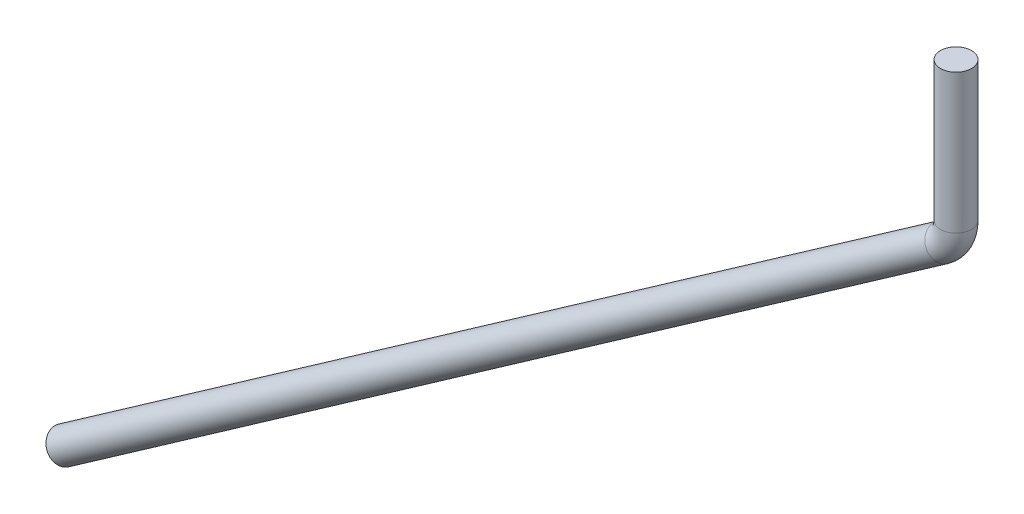
ISO-10303-21;
HEADER;
FILE_DESCRIPTION(('STEP AP214'),'2;1');
FILE_NAME('part.step','',(''),(''),'','','');
FILE_SCHEMA(('AUTOMOTIVE_DESIGN { 1 0 10303 214 1 1 1 1 }'));
ENDSEC;
DATA;
#1=APPLICATION_CONTEXT('core data for automotive mechanical design processes');
#2=APPLICATION_PROTOCOL_DEFINITION('international standard','automotive_design',2000,#1);
#3=PRODUCT_CONTEXT('',#1,'mechanical');
#4=PRODUCT('Part','Part','',(#3));
#5=PRODUCT_RELATED_PRODUCT_CATEGORY('part','',(#4));
#6=PRODUCT_DEFINITION_FORMATION('','',#4);
#7=PRODUCT_DEFINITION_CONTEXT('part definition',#1,'design');
#8=PRODUCT_DEFINITION('design','',#6,#7);
#9=PRODUCT_DEFINITION_SHAPE('','',#8);
#10=(LENGTH_UNIT() NAMED_UNIT(*) SI_UNIT(.MILLI.,.METRE.));
#11=(NAMED_UNIT(*) PLANE_ANGLE_UNIT() SI_UNIT($,.RADIAN.));
#12=(NAMED_UNIT(*) SI_UNIT($,.STERADIAN.) SOLID_ANGLE_UNIT());
#13=UNCERTAINTY_MEASURE_WITH_UNIT(LENGTH_MEASURE(1.E-05),#10,'distance_accuracy_value','');
#14=(GEOMETRIC_REPRESENTATION_CONTEXT(3) GLOBAL_UNCERTAINTY_ASSIGNED_CONTEXT((#13)) GLOBAL_UNIT_ASSIGNED_CONTEXT((#10,
#11,#12)) REPRESENTATION_CONTEXT('',''));
#15=CARTESIAN_POINT('',(0.,0.,0.));
#16=DIRECTION('',(0.,0.,1.));
#17=DIRECTION('',(1.,0.,0.));
#18=AXIS2_PLACEMENT_3D('',#15,#16,#17);
#19=CARTESIAN_POINT('',(0.,0.,0.));
#20=DIRECTION('',(0.,1.,0.));
#21=DIRECTION('',(-1.,0.,0.));
#22=AXIS2_PLACEMENT_3D('',#19,#20,#21);
#23=PLANE('',#22);
#24=CARTESIAN_POINT('',(0.,0.,0.));
#25=DIRECTION('',(0.,1.,0.));
#26=DIRECTION('',(-1.,0.,0.));
#27=AXIS2_PLACEMENT_3D('',#24,#25,#26);
#28=CIRCLE('',#27,0.127);
#29=CARTESIAN_POINT('',(-0.127,0.,0.));
#30=VERTEX_POINT('',#29);
#31=EDGE_CURVE('E61',#30,#30,#28,.T.);
#32=ORIENTED_EDGE('',*,*,#31,.T.);
#33=EDGE_LOOP('',(#32));
#34=FACE_BOUND('',#33,.T.);
#35=ADVANCED_FACE('F47',(#34),#23,.T.);
#36=CARTESIAN_POINT('',(-7.28226167372915,-6.36909451916079,0.));
#37=DIRECTION('',(0.819152044288993,0.573576436351045,0.));
#38=DIRECTION('',(-0.573576436351045,0.819152044288993,0.));
#39=AXIS2_PLACEMENT_3D('',#36,#37,#38);
#40=PLANE('',#39);
#41=CARTESIAN_POINT('',(-7.28226167372915,-6.36909451916079,0.));
#42=DIRECTION('',(0.819152044288993,0.573576436351045,0.));
#43=DIRECTION('',(-0.573576436351045,0.819152044288993,0.));
#44=AXIS2_PLACEMENT_3D('',#41,#42,#43);
#45=CIRCLE('',#44,0.127);
#46=CARTESIAN_POINT('',(-7.35510588114573,-6.26506220953608,0.));
#47=VERTEX_POINT('',#46);
#48=EDGE_CURVE('E11',#47,#47,#45,.T.);
#49=ORIENTED_EDGE('',*,*,#48,.F.);
#50=EDGE_LOOP('',(#49));
#51=FACE_BOUND('',#50,.T.);
#52=ADVANCED_FACE('F71',(#51),#40,.F.);
#53=CARTESIAN_POINT('',(0.,0.,0.));
#54=DIRECTION('',(0.,-1.,0.));
#55=DIRECTION('',(1.,0.,0.));
#56=AXIS2_PLACEMENT_3D('',#53,#54,#55);
#57=CYLINDRICAL_SURFACE('',#56,0.127);
#58=CARTESIAN_POINT('',(0.,-1.13777596915986,0.));
#59=DIRECTION('',(0.,1.,0.));
#60=DIRECTION('',(-1.,0.,0.));
#61=AXIS2_PLACEMENT_3D('',#58,#59,#60);
#62=CIRCLE('',#61,0.127);
#63=CARTESIAN_POINT('',(0.127000000000001,-1.13777596915986,0.));
#64=VERTEX_POINT('',#63);
#65=EDGE_CURVE('E57',#64,#64,#62,.T.);
#66=ORIENTED_EDGE('',*,*,#65,.T.);
#67=EDGE_LOOP('',(#66));
#68=FACE_BOUND('',#67,.T.);
#69=ORIENTED_EDGE('',*,*,#31,.F.);
#70=EDGE_LOOP('',(#69));
#71=FACE_BOUND('',#70,.T.);
#72=ADVANCED_FACE('F68',(#68,#71),#57,.T.);
#73=CARTESIAN_POINT('',(-0.254,-1.13777596915986,0.));
#74=DIRECTION('',(0.,0.,-1.));
#75=DIRECTION('',(-1.,0.,0.));
#76=AXIS2_PLACEMENT_3D('',#73,#74,#75);
#77=TOROIDAL_SURFACE('',#76,0.254000000000001,0.127);
#78=CARTESIAN_POINT('',(-0.108311585166838,-1.34584058840926,0.));
#79=DIRECTION('',(0.819152044288993,0.573576436351045,0.));
#80=DIRECTION('',(-0.573576436351045,0.819152044288993,0.));
#81=AXIS2_PLACEMENT_3D('',#78,#79,#80);
#82=CIRCLE('',#81,0.127);
#83=CARTESIAN_POINT('',(-0.0354673777502547,-1.44987289803397,0.));
#84=VERTEX_POINT('',#83);
#85=EDGE_CURVE('E53',#84,#84,#82,.T.);
#86=CARTESIAN_POINT('',(-0.254,-1.13777596915986,0.));
#87=DIRECTION('',(0.,0.,-1.));
#88=DIRECTION('',(-1.,0.,0.));
#89=AXIS2_PLACEMENT_3D('',#86,#87,#88);
#90=CIRCLE('',#89,0.381000000000001);
#91=EDGE_CURVE('',#64,#84,#90,.T.);
#92=ORIENTED_EDGE('',*,*,#65,.F.);
#93=ORIENTED_EDGE('',*,*,#85,.T.);
#94=ORIENTED_EDGE('',*,*,#91,.T.);
#95=ORIENTED_EDGE('',*,*,#91,.F.);
#96=EDGE_LOOP('',(#92,#94,#93,#95));
#97=FACE_BOUND('',#96,.T.);
#98=ADVANCED_FACE('F70',(#97),#77,.T.);
#99=CARTESIAN_POINT('',(-0.108311585166835,-1.34584058840926,0.));
#100=DIRECTION('',(-0.819152044288993,-0.573576436351044,0.));
#101=DIRECTION('',(0.573576436351044,-0.819152044288993,0.));
#102=AXIS2_PLACEMENT_3D('',#99,#100,#101);
#103=CYLINDRICAL_SURFACE('',#102,0.127);
#104=ORIENTED_EDGE('',*,*,#48,.T.);
#105=EDGE_LOOP('',(#104));
#106=FACE_BOUND('',#105,.T.);
#107=ORIENTED_EDGE('',*,*,#85,.F.);
#108=EDGE_LOOP('',(#107));
#109=FACE_BOUND('',#108,.T.);
#110=ADVANCED_FACE('F78',(#106,#109),#103,.T.);
#111=CLOSED_SHELL('',(#35,#52,#72,#98,#110));
#112=MANIFOLD_SOLID_BREP('B2',#111);
#113=ADVANCED_BREP_SHAPE_REPRESENTATION('',(#18,#112),#14);
#114=SHAPE_DEFINITION_REPRESENTATION(#9,#113);
ENDSEC;
END-ISO-10303-21;
